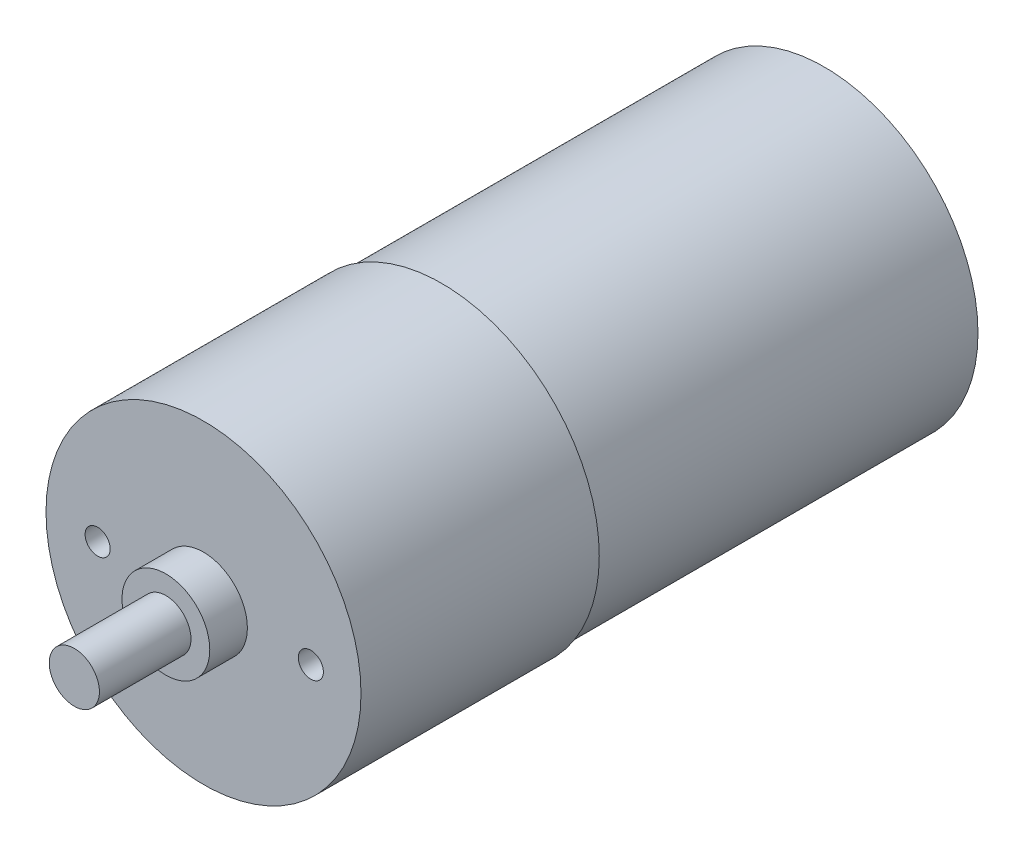
ISO-10303-21;
HEADER;
FILE_DESCRIPTION(('STEP AP214'),'2;1');
FILE_NAME('part.step','',(''),(''),'','','');
FILE_SCHEMA(('AUTOMOTIVE_DESIGN { 1 0 10303 214 1 1 1 1 }'));
ENDSEC;
DATA;
#1=APPLICATION_CONTEXT('core data for automotive mechanical design processes');
#2=APPLICATION_PROTOCOL_DEFINITION('international standard','automotive_design',2000,#1);
#3=PRODUCT_CONTEXT('',#1,'mechanical');
#4=PRODUCT('Part','Part','',(#3));
#5=PRODUCT_RELATED_PRODUCT_CATEGORY('part','',(#4));
#6=PRODUCT_DEFINITION_FORMATION('','',#4);
#7=PRODUCT_DEFINITION_CONTEXT('part definition',#1,'design');
#8=PRODUCT_DEFINITION('design','',#6,#7);
#9=PRODUCT_DEFINITION_SHAPE('','',#8);
#10=(LENGTH_UNIT() NAMED_UNIT(*) SI_UNIT(.MILLI.,.METRE.));
#11=(NAMED_UNIT(*) PLANE_ANGLE_UNIT() SI_UNIT($,.RADIAN.));
#12=(NAMED_UNIT(*) SI_UNIT($,.STERADIAN.) SOLID_ANGLE_UNIT());
#13=UNCERTAINTY_MEASURE_WITH_UNIT(LENGTH_MEASURE(1.E-05),#10,'distance_accuracy_value','');
#14=(GEOMETRIC_REPRESENTATION_CONTEXT(3) GLOBAL_UNCERTAINTY_ASSIGNED_CONTEXT((#13)) GLOBAL_UNIT_ASSIGNED_CONTEXT((#10,
#11,#12)) REPRESENTATION_CONTEXT('',''));
#15=CARTESIAN_POINT('',(0.,0.,0.));
#16=DIRECTION('',(0.,0.,1.));
#17=DIRECTION('',(1.,0.,0.));
#18=AXIS2_PLACEMENT_3D('',#15,#16,#17);
#19=CARTESIAN_POINT('',(0.,1444.4928613886,2824.90928314663));
#20=DIRECTION('',(0.,0.,1.));
#21=DIRECTION('',(1.,0.,0.));
#22=AXIS2_PLACEMENT_3D('',#19,#20,#21);
#23=CYLINDRICAL_SURFACE('',#22,12.25907);
#24=CARTESIAN_POINT('',(0.,1444.4928613886,2765.10928314663));
#25=DIRECTION('',(0.,0.,1.));
#26=DIRECTION('',(1.,0.,0.));
#27=AXIS2_PLACEMENT_3D('',#24,#25,#26);
#28=CIRCLE('',#27,12.25907);
#29=CARTESIAN_POINT('',(12.25907,1444.4928613886,2765.10928314663));
#30=VERTEX_POINT('',#29);
#31=EDGE_CURVE('E67',#30,#30,#28,.T.);
#32=ORIENTED_EDGE('',*,*,#31,.T.);
#33=EDGE_LOOP('',(#32));
#34=FACE_BOUND('',#33,.T.);
#35=CARTESIAN_POINT('',(0.,1444.4928613886,2795.60928314663));
#36=DIRECTION('',(0.,0.,1.));
#37=DIRECTION('',(1.,0.,0.));
#38=AXIS2_PLACEMENT_3D('',#35,#36,#37);
#39=CIRCLE('',#38,12.25907);
#40=CARTESIAN_POINT('',(12.25907,1444.4928613886,2795.60928314663));
#41=VERTEX_POINT('',#40);
#42=EDGE_CURVE('E10',#41,#41,#39,.T.);
#43=ORIENTED_EDGE('',*,*,#42,.F.);
#44=EDGE_LOOP('',(#43));
#45=FACE_BOUND('',#44,.T.);
#46=ADVANCED_FACE('F33',(#34,#45),#23,.T.);
#47=CARTESIAN_POINT('',(0.,0.,2795.60928314663));
#48=DIRECTION('',(0.,0.,-1.));
#49=DIRECTION('',(-1.,0.,0.));
#50=AXIS2_PLACEMENT_3D('',#47,#48,#49);
#51=PLANE('',#50);
#52=ORIENTED_EDGE('',*,*,#42,.T.);
#53=EDGE_LOOP('',(#52));
#54=FACE_BOUND('',#53,.T.);
#55=CARTESIAN_POINT('',(0.,1444.4928613886,2795.60928314663));
#56=DIRECTION('',(0.,0.,1.));
#57=DIRECTION('',(1.,0.,0.));
#58=AXIS2_PLACEMENT_3D('',#55,#56,#57);
#59=CIRCLE('',#58,12.55907);
#60=CARTESIAN_POINT('',(12.55907,1444.4928613886,2795.60928314663));
#61=VERTEX_POINT('',#60);
#62=EDGE_CURVE('E39',#61,#61,#59,.T.);
#63=ORIENTED_EDGE('',*,*,#62,.F.);
#64=EDGE_LOOP('',(#63));
#65=FACE_BOUND('',#64,.T.);
#66=ADVANCED_FACE('F98',(#54,#65),#51,.T.);
#67=CARTESIAN_POINT('',(0.,1444.4928613886,2824.90928314663));
#68=DIRECTION('',(0.,0.,1.));
#69=DIRECTION('',(1.,0.,0.));
#70=AXIS2_PLACEMENT_3D('',#67,#68,#69);
#71=CYLINDRICAL_SURFACE('',#70,12.55907);
#72=CARTESIAN_POINT('',(0.,1444.4928613886,2814.60928314663));
#73=DIRECTION('',(0.,0.,1.));
#74=DIRECTION('',(1.,0.,0.));
#75=AXIS2_PLACEMENT_3D('',#72,#73,#74);
#76=CIRCLE('',#75,12.55907);
#77=CARTESIAN_POINT('',(12.55907,1444.4928613886,2814.60928314663));
#78=VERTEX_POINT('',#77);
#79=EDGE_CURVE('E43',#78,#78,#76,.T.);
#80=ORIENTED_EDGE('',*,*,#79,.F.);
#81=EDGE_LOOP('',(#80));
#82=FACE_BOUND('',#81,.T.);
#83=ORIENTED_EDGE('',*,*,#62,.T.);
#84=EDGE_LOOP('',(#83));
#85=FACE_BOUND('',#84,.T.);
#86=ADVANCED_FACE('F89',(#82,#85),#71,.T.);
#87=CARTESIAN_POINT('',(0.,0.,2814.60928314663));
#88=DIRECTION('',(0.,0.,-1.));
#89=DIRECTION('',(-1.,0.,0.));
#90=AXIS2_PLACEMENT_3D('',#87,#88,#89);
#91=PLANE('',#90);
#92=CARTESIAN_POINT('',(8.55907000000003,1444.4928613886,2814.60928314663));
#93=DIRECTION('',(0.,0.,1.));
#94=DIRECTION('',(1.,0.,0.));
#95=AXIS2_PLACEMENT_3D('',#92,#93,#94);
#96=CIRCLE('',#95,1.);
#97=CARTESIAN_POINT('',(9.55907000000003,1444.4928613886,2814.60928314663));
#98=VERTEX_POINT('',#97);
#99=EDGE_CURVE('E74',#98,#98,#96,.T.);
#100=ORIENTED_EDGE('',*,*,#99,.F.);
#101=EDGE_LOOP('',(#100));
#102=FACE_BOUND('',#101,.T.);
#103=CARTESIAN_POINT('',(-8.44092999999997,1444.4928613886,2814.60928314663));
#104=DIRECTION('',(0.,0.,1.));
#105=DIRECTION('',(1.,0.,0.));
#106=AXIS2_PLACEMENT_3D('',#103,#104,#105);
#107=CIRCLE('',#106,1.);
#108=CARTESIAN_POINT('',(-7.44092999999997,1444.4928613886,2814.60928314663));
#109=VERTEX_POINT('',#108);
#110=EDGE_CURVE('E71',#109,#109,#107,.T.);
#111=ORIENTED_EDGE('',*,*,#110,.F.);
#112=EDGE_LOOP('',(#111));
#113=FACE_BOUND('',#112,.T.);
#114=CARTESIAN_POINT('',(0.,1444.4928613886,2814.60928314663));
#115=DIRECTION('',(0.,0.,1.));
#116=DIRECTION('',(1.,0.,0.));
#117=AXIS2_PLACEMENT_3D('',#114,#115,#116);
#118=CIRCLE('',#117,3.49986999999996);
#119=CARTESIAN_POINT('',(3.49986999999996,1444.4928613886,2814.60928314663));
#120=VERTEX_POINT('',#119);
#121=EDGE_CURVE('E47',#120,#120,#118,.T.);
#122=ORIENTED_EDGE('',*,*,#121,.F.);
#123=EDGE_LOOP('',(#122));
#124=FACE_BOUND('',#123,.T.);
#125=ORIENTED_EDGE('',*,*,#79,.T.);
#126=EDGE_LOOP('',(#125));
#127=FACE_BOUND('',#126,.T.);
#128=ADVANCED_FACE('F85',(#102,#113,#124,#127),#91,.F.);
#129=CARTESIAN_POINT('',(0.,1444.4928613886,2824.90928314663));
#130=DIRECTION('',(0.,0.,1.));
#131=DIRECTION('',(1.,0.,0.));
#132=AXIS2_PLACEMENT_3D('',#129,#130,#131);
#133=CYLINDRICAL_SURFACE('',#132,3.49986999999996);
#134=CARTESIAN_POINT('',(0.,1444.4928613886,2817.60928314663));
#135=DIRECTION('',(0.,0.,1.));
#136=DIRECTION('',(1.,0.,0.));
#137=AXIS2_PLACEMENT_3D('',#134,#135,#136);
#138=CIRCLE('',#137,3.49986999999996);
#139=CARTESIAN_POINT('',(3.49986999999996,1444.4928613886,2817.60928314663));
#140=VERTEX_POINT('',#139);
#141=EDGE_CURVE('E52',#140,#140,#138,.T.);
#142=ORIENTED_EDGE('',*,*,#141,.F.);
#143=EDGE_LOOP('',(#142));
#144=FACE_BOUND('',#143,.T.);
#145=ORIENTED_EDGE('',*,*,#121,.T.);
#146=EDGE_LOOP('',(#145));
#147=FACE_BOUND('',#146,.T.);
#148=ADVANCED_FACE('F88',(#144,#147),#133,.T.);
#149=CARTESIAN_POINT('',(0.,0.,2817.60928314663));
#150=DIRECTION('',(0.,0.,-1.));
#151=DIRECTION('',(-1.,0.,0.));
#152=AXIS2_PLACEMENT_3D('',#149,#150,#151);
#153=PLANE('',#152);
#154=CARTESIAN_POINT('',(0.,1444.4928613886,2817.60928314663));
#155=DIRECTION('',(0.,0.,1.));
#156=DIRECTION('',(1.,0.,0.));
#157=AXIS2_PLACEMENT_3D('',#154,#155,#156);
#158=CIRCLE('',#157,2.);
#159=CARTESIAN_POINT('',(2.,1444.4928613886,2817.60928314663));
#160=VERTEX_POINT('',#159);
#161=EDGE_CURVE('E55',#160,#160,#158,.T.);
#162=ORIENTED_EDGE('',*,*,#161,.F.);
#163=EDGE_LOOP('',(#162));
#164=FACE_BOUND('',#163,.T.);
#165=ORIENTED_EDGE('',*,*,#141,.T.);
#166=EDGE_LOOP('',(#165));
#167=FACE_BOUND('',#166,.T.);
#168=ADVANCED_FACE('F138',(#164,#167),#153,.F.);
#169=CARTESIAN_POINT('',(0.,1444.4928613886,2824.90928314663));
#170=DIRECTION('',(0.,0.,1.));
#171=DIRECTION('',(1.,0.,0.));
#172=AXIS2_PLACEMENT_3D('',#169,#170,#171);
#173=CYLINDRICAL_SURFACE('',#172,2.);
#174=CARTESIAN_POINT('',(0.,1444.4928613886,2824.90928314663));
#175=DIRECTION('',(0.,0.,1.));
#176=DIRECTION('',(1.,0.,0.));
#177=AXIS2_PLACEMENT_3D('',#174,#175,#176);
#178=CIRCLE('',#177,2.);
#179=CARTESIAN_POINT('',(2.,1444.4928613886,2824.90928314663));
#180=VERTEX_POINT('',#179);
#181=EDGE_CURVE('E58',#180,#180,#178,.T.);
#182=ORIENTED_EDGE('',*,*,#181,.F.);
#183=EDGE_LOOP('',(#182));
#184=FACE_BOUND('',#183,.T.);
#185=ORIENTED_EDGE('',*,*,#161,.T.);
#186=EDGE_LOOP('',(#185));
#187=FACE_BOUND('',#186,.T.);
#188=ADVANCED_FACE('F134',(#184,#187),#173,.T.);
#189=CARTESIAN_POINT('',(0.,0.,2824.90928314663));
#190=DIRECTION('',(0.,0.,-1.));
#191=DIRECTION('',(-1.,0.,0.));
#192=AXIS2_PLACEMENT_3D('',#189,#190,#191);
#193=PLANE('',#192);
#194=ORIENTED_EDGE('',*,*,#181,.T.);
#195=EDGE_LOOP('',(#194));
#196=FACE_BOUND('',#195,.T.);
#197=ADVANCED_FACE('F130',(#196),#193,.F.);
#198=CARTESIAN_POINT('',(0.,0.,2763.00928314663));
#199=DIRECTION('',(0.,0.,-1.));
#200=DIRECTION('',(-1.,0.,0.));
#201=AXIS2_PLACEMENT_3D('',#198,#199,#200);
#202=PLANE('',#201);
#203=CARTESIAN_POINT('',(0.,1444.4928613886,2763.00928314663));
#204=DIRECTION('',(0.,0.,1.));
#205=DIRECTION('',(1.,0.,0.));
#206=AXIS2_PLACEMENT_3D('',#203,#204,#205);
#207=CIRCLE('',#206,2.);
#208=CARTESIAN_POINT('',(2.,1444.4928613886,2763.00928314663));
#209=VERTEX_POINT('',#208);
#210=EDGE_CURVE('E61',#209,#209,#207,.T.);
#211=ORIENTED_EDGE('',*,*,#210,.F.);
#212=EDGE_LOOP('',(#211));
#213=FACE_BOUND('',#212,.T.);
#214=ADVANCED_FACE('F123',(#213),#202,.T.);
#215=CARTESIAN_POINT('',(0.,1444.4928613886,2824.90928314663));
#216=DIRECTION('',(0.,0.,1.));
#217=DIRECTION('',(1.,0.,0.));
#218=AXIS2_PLACEMENT_3D('',#215,#216,#217);
#219=CYLINDRICAL_SURFACE('',#218,2.);
#220=ORIENTED_EDGE('',*,*,#210,.T.);
#221=EDGE_LOOP('',(#220));
#222=FACE_BOUND('',#221,.T.);
#223=CARTESIAN_POINT('',(0.,1444.4928613886,2765.10928314663));
#224=DIRECTION('',(0.,0.,1.));
#225=DIRECTION('',(1.,0.,0.));
#226=AXIS2_PLACEMENT_3D('',#223,#224,#225);
#227=CIRCLE('',#226,2.);
#228=CARTESIAN_POINT('',(2.,1444.4928613886,2765.10928314663));
#229=VERTEX_POINT('',#228);
#230=EDGE_CURVE('E64',#229,#229,#227,.T.);
#231=ORIENTED_EDGE('',*,*,#230,.F.);
#232=EDGE_LOOP('',(#231));
#233=FACE_BOUND('',#232,.T.);
#234=ADVANCED_FACE('F113',(#222,#233),#219,.T.);
#235=CARTESIAN_POINT('',(0.,5.03260326517078E-11,2765.10928314663));
#236=DIRECTION('',(0.,0.,-1.));
#237=DIRECTION('',(-1.,0.,0.));
#238=AXIS2_PLACEMENT_3D('',#235,#236,#237);
#239=PLANE('',#238);
#240=ORIENTED_EDGE('',*,*,#230,.T.);
#241=EDGE_LOOP('',(#240));
#242=FACE_BOUND('',#241,.T.);
#243=ORIENTED_EDGE('',*,*,#31,.F.);
#244=EDGE_LOOP('',(#243));
#245=FACE_BOUND('',#244,.T.);
#246=ADVANCED_FACE('F110',(#242,#245),#239,.T.);
#247=CARTESIAN_POINT('',(-8.44092999999997,1444.4928613886,2812.06928314663));
#248=DIRECTION('',(0.,0.,1.));
#249=DIRECTION('',(1.,0.,0.));
#250=AXIS2_PLACEMENT_3D('',#247,#248,#249);
#251=CYLINDRICAL_SURFACE('',#250,1.);
#252=CARTESIAN_POINT('',(-8.44092999999997,1444.4928613886,2812.06928314663));
#253=DIRECTION('',(0.,0.,1.));
#254=DIRECTION('',(1.,0.,0.));
#255=AXIS2_PLACEMENT_3D('',#252,#253,#254);
#256=CIRCLE('',#255,1.);
#257=CARTESIAN_POINT('',(-7.44092999999997,1444.4928613886,2812.06928314663));
#258=VERTEX_POINT('',#257);
#259=EDGE_CURVE('E70',#258,#258,#256,.T.);
#260=ORIENTED_EDGE('',*,*,#259,.F.);
#261=EDGE_LOOP('',(#260));
#262=FACE_BOUND('',#261,.T.);
#263=ORIENTED_EDGE('',*,*,#110,.T.);
#264=EDGE_LOOP('',(#263));
#265=FACE_BOUND('',#264,.T.);
#266=ADVANCED_FACE('F112',(#262,#265),#251,.F.);
#267=CARTESIAN_POINT('',(-8.44092999999997,1444.4928613886,2812.06928314663));
#268=DIRECTION('',(0.,0.,1.));
#269=DIRECTION('',(1.,0.,0.));
#270=AXIS2_PLACEMENT_3D('',#267,#268,#269);
#271=PLANE('',#270);
#272=ORIENTED_EDGE('',*,*,#259,.T.);
#273=EDGE_LOOP('',(#272));
#274=FACE_BOUND('',#273,.T.);
#275=ADVANCED_FACE('F120',(#274),#271,.T.);
#276=CARTESIAN_POINT('',(8.55907000000003,1444.4928613886,2812.06928314663));
#277=DIRECTION('',(0.,0.,1.));
#278=DIRECTION('',(1.,0.,0.));
#279=AXIS2_PLACEMENT_3D('',#276,#277,#278);
#280=CYLINDRICAL_SURFACE('',#279,1.);
#281=CARTESIAN_POINT('',(8.55907000000003,1444.4928613886,2812.06928314663));
#282=DIRECTION('',(0.,0.,1.));
#283=DIRECTION('',(1.,0.,0.));
#284=AXIS2_PLACEMENT_3D('',#281,#282,#283);
#285=CIRCLE('',#284,1.);
#286=CARTESIAN_POINT('',(9.55907000000003,1444.4928613886,2812.06928314663));
#287=VERTEX_POINT('',#286);
#288=EDGE_CURVE('E77',#287,#287,#285,.T.);
#289=ORIENTED_EDGE('',*,*,#288,.F.);
#290=EDGE_LOOP('',(#289));
#291=FACE_BOUND('',#290,.T.);
#292=ORIENTED_EDGE('',*,*,#99,.T.);
#293=EDGE_LOOP('',(#292));
#294=FACE_BOUND('',#293,.T.);
#295=ADVANCED_FACE('F83',(#291,#294),#280,.F.);
#296=CARTESIAN_POINT('',(8.55907000000003,1444.4928613886,2812.06928314663));
#297=DIRECTION('',(0.,0.,1.));
#298=DIRECTION('',(1.,0.,0.));
#299=AXIS2_PLACEMENT_3D('',#296,#297,#298);
#300=PLANE('',#299);
#301=ORIENTED_EDGE('',*,*,#288,.T.);
#302=EDGE_LOOP('',(#301));
#303=FACE_BOUND('',#302,.T.);
#304=ADVANCED_FACE('F205',(#303),#300,.T.);
#305=CLOSED_SHELL('',(#46,#66,#86,#128,#148,#168,#188,#197,#214,#234,#246,#266,#275,#295,#304));
#306=MANIFOLD_SOLID_BREP('B2',#305);
#307=ADVANCED_BREP_SHAPE_REPRESENTATION('',(#18,#306),#14);
#308=SHAPE_DEFINITION_REPRESENTATION(#9,#307);
ENDSEC;
END-ISO-10303-21;
